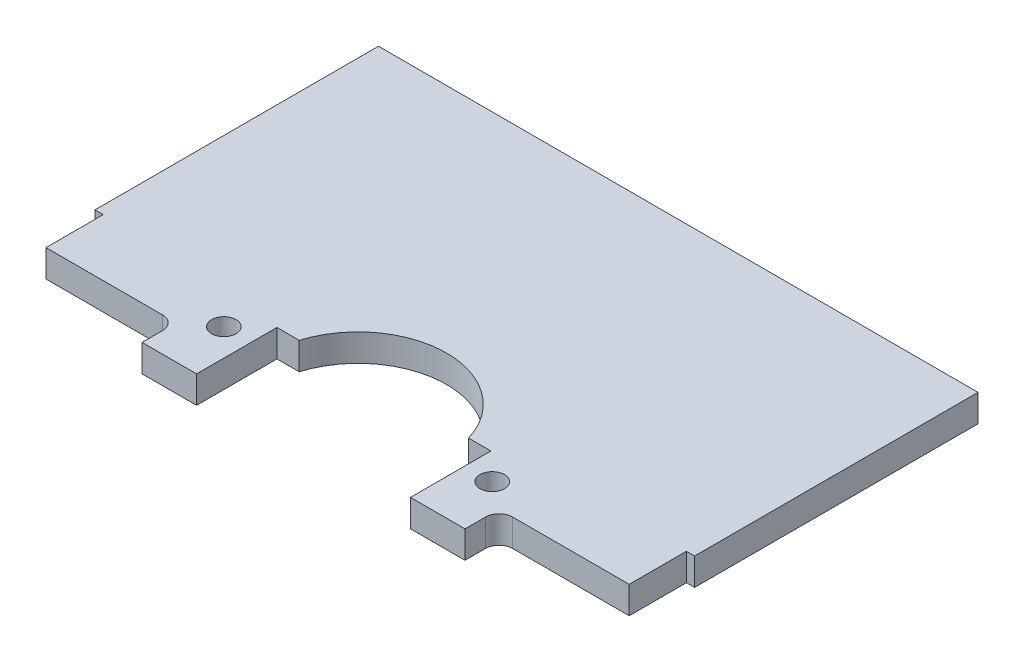
ISO-10303-21;
HEADER;
FILE_DESCRIPTION(('STEP AP214'),'2;1');
FILE_NAME('part.step','',(''),(''),'','','');
FILE_SCHEMA(('AUTOMOTIVE_DESIGN { 1 0 10303 214 1 1 1 1 }'));
ENDSEC;
DATA;
#1=APPLICATION_CONTEXT('core data for automotive mechanical design processes');
#2=APPLICATION_PROTOCOL_DEFINITION('international standard','automotive_design',2000,#1);
#3=PRODUCT_CONTEXT('',#1,'mechanical');
#4=PRODUCT('Part','Part','',(#3));
#5=PRODUCT_RELATED_PRODUCT_CATEGORY('part','',(#4));
#6=PRODUCT_DEFINITION_FORMATION('','',#4);
#7=PRODUCT_DEFINITION_CONTEXT('part definition',#1,'design');
#8=PRODUCT_DEFINITION('design','',#6,#7);
#9=PRODUCT_DEFINITION_SHAPE('','',#8);
#10=(LENGTH_UNIT() NAMED_UNIT(*) SI_UNIT(.MILLI.,.METRE.));
#11=(NAMED_UNIT(*) PLANE_ANGLE_UNIT() SI_UNIT($,.RADIAN.));
#12=(NAMED_UNIT(*) SI_UNIT($,.STERADIAN.) SOLID_ANGLE_UNIT());
#13=UNCERTAINTY_MEASURE_WITH_UNIT(LENGTH_MEASURE(1.E-05),#10,'distance_accuracy_value','');
#14=(GEOMETRIC_REPRESENTATION_CONTEXT(3) GLOBAL_UNCERTAINTY_ASSIGNED_CONTEXT((#13)) GLOBAL_UNIT_ASSIGNED_CONTEXT((#10,
#11,#12)) REPRESENTATION_CONTEXT('',''));
#15=CARTESIAN_POINT('',(0.,0.,0.));
#16=DIRECTION('',(0.,0.,1.));
#17=DIRECTION('',(1.,0.,0.));
#18=AXIS2_PLACEMENT_3D('',#15,#16,#17);
#19=CARTESIAN_POINT('',(0.,2.54,13.208));
#20=DIRECTION('',(0.,0.,-1.));
#21=DIRECTION('',(-1.,0.,0.));
#22=AXIS2_PLACEMENT_3D('',#19,#20,#21);
#23=PLANE('',#22);
#24=DIRECTION('',(1.,0.,0.));
#25=VECTOR('',#24,1.);
#26=CARTESIAN_POINT('',(0.,0.,13.208));
#27=LINE('',#26,#25);
#28=CARTESIAN_POINT('',(-27.94,0.,13.208));
#29=VERTEX_POINT('',#28);
#30=CARTESIAN_POINT('',(-27.178,0.,13.208));
#31=VERTEX_POINT('',#30);
#32=EDGE_CURVE('E189',#29,#31,#27,.T.);
#33=ORIENTED_EDGE('',*,*,#32,.T.);
#34=DIRECTION('',(0.,-1.,0.));
#35=VECTOR('',#34,1.);
#36=CARTESIAN_POINT('',(-27.178,2.54,13.208));
#37=LINE('',#36,#35);
#38=CARTESIAN_POINT('',(-27.178,2.54,13.208));
#39=VERTEX_POINT('',#38);
#40=EDGE_CURVE('E187',#39,#31,#37,.T.);
#41=ORIENTED_EDGE('',*,*,#40,.F.);
#42=DIRECTION('',(1.,0.,0.));
#43=VECTOR('',#42,1.);
#44=CARTESIAN_POINT('',(0.,2.54,13.208));
#45=LINE('',#44,#43);
#46=CARTESIAN_POINT('',(-27.94,2.54,13.208));
#47=VERTEX_POINT('',#46);
#48=EDGE_CURVE('E172',#47,#39,#45,.T.);
#49=ORIENTED_EDGE('',*,*,#48,.F.);
#50=DIRECTION('',(0.,-1.,0.));
#51=VECTOR('',#50,1.);
#52=CARTESIAN_POINT('',(-27.94,2.54,13.208));
#53=LINE('',#52,#51);
#54=EDGE_CURVE('E237',#47,#29,#53,.T.);
#55=ORIENTED_EDGE('',*,*,#54,.T.);
#56=EDGE_LOOP('',(#33,#41,#49,#55));
#57=FACE_BOUND('',#56,.T.);
#58=ADVANCED_FACE('F34',(#57),#23,.F.);
#59=CARTESIAN_POINT('',(-27.178,2.54,0.));
#60=DIRECTION('',(-1.,0.,0.));
#61=DIRECTION('',(0.,0.,1.));
#62=AXIS2_PLACEMENT_3D('',#59,#60,#61);
#63=PLANE('',#62);
#64=DIRECTION('',(0.,0.,-1.));
#65=VECTOR('',#64,1.);
#66=CARTESIAN_POINT('',(-27.178,0.,0.));
#67=LINE('',#66,#65);
#68=CARTESIAN_POINT('',(-27.178,0.,18.542));
#69=VERTEX_POINT('',#68);
#70=EDGE_CURVE('E239',#69,#31,#67,.T.);
#71=ORIENTED_EDGE('',*,*,#70,.F.);
#72=DIRECTION('',(0.,-1.,0.));
#73=VECTOR('',#72,1.);
#74=CARTESIAN_POINT('',(-27.178,2.54,18.542));
#75=LINE('',#74,#73);
#76=CARTESIAN_POINT('',(-27.178,2.54,18.542));
#77=VERTEX_POINT('',#76);
#78=EDGE_CURVE('E194',#77,#69,#75,.T.);
#79=ORIENTED_EDGE('',*,*,#78,.F.);
#80=DIRECTION('',(0.,0.,-1.));
#81=VECTOR('',#80,1.);
#82=CARTESIAN_POINT('',(-27.178,2.54,0.));
#83=LINE('',#82,#81);
#84=EDGE_CURVE('E178',#77,#39,#83,.T.);
#85=ORIENTED_EDGE('',*,*,#84,.T.);
#86=ORIENTED_EDGE('',*,*,#40,.T.);
#87=EDGE_LOOP('',(#71,#79,#85,#86));
#88=FACE_BOUND('',#87,.T.);
#89=ADVANCED_FACE('F196',(#88),#63,.T.);
#90=CARTESIAN_POINT('',(0.,2.54,18.542));
#91=DIRECTION('',(0.,0.,-1.));
#92=DIRECTION('',(-1.,0.,0.));
#93=AXIS2_PLACEMENT_3D('',#90,#91,#92);
#94=PLANE('',#93);
#95=DIRECTION('',(1.,0.,0.));
#96=VECTOR('',#95,1.);
#97=CARTESIAN_POINT('',(0.,0.,18.542));
#98=LINE('',#97,#96);
#99=CARTESIAN_POINT('',(-16.3195,0.,18.542));
#100=VERTEX_POINT('',#99);
#101=EDGE_CURVE('E242',#69,#100,#98,.T.);
#102=ORIENTED_EDGE('',*,*,#101,.T.);
#103=DIRECTION('',(0.,-1.,0.));
#104=VECTOR('',#103,1.);
#105=CARTESIAN_POINT('',(-16.3195,2.54,18.542));
#106=LINE('',#105,#104);
#107=CARTESIAN_POINT('',(-16.3195,2.54,18.542));
#108=VERTEX_POINT('',#107);
#109=EDGE_CURVE('E322',#100,#108,#106,.F.);
#110=ORIENTED_EDGE('',*,*,#109,.T.);
#111=DIRECTION('',(1.,0.,0.));
#112=VECTOR('',#111,1.);
#113=CARTESIAN_POINT('',(0.,2.54,18.542));
#114=LINE('',#113,#112);
#115=EDGE_CURVE('E198',#77,#108,#114,.T.);
#116=ORIENTED_EDGE('',*,*,#115,.F.);
#117=ORIENTED_EDGE('',*,*,#78,.T.);
#118=EDGE_LOOP('',(#102,#110,#116,#117));
#119=FACE_BOUND('',#118,.T.);
#120=ADVANCED_FACE('F346',(#119),#94,.F.);
#121=CARTESIAN_POINT('',(-15.0495,2.54,0.));
#122=DIRECTION('',(-1.,0.,0.));
#123=DIRECTION('',(0.,0.,1.));
#124=AXIS2_PLACEMENT_3D('',#121,#122,#123);
#125=PLANE('',#124);
#126=DIRECTION('',(0.,0.,-1.));
#127=VECTOR('',#126,1.);
#128=CARTESIAN_POINT('',(-15.0495,2.54,0.));
#129=LINE('',#128,#127);
#130=CARTESIAN_POINT('',(-15.0495,2.54,21.717));
#131=VERTEX_POINT('',#130);
#132=CARTESIAN_POINT('',(-15.0495,2.54,19.812));
#133=VERTEX_POINT('',#132);
#134=EDGE_CURVE('E200',#131,#133,#129,.T.);
#135=ORIENTED_EDGE('',*,*,#134,.T.);
#136=DIRECTION('',(0.,-1.,0.));
#137=VECTOR('',#136,1.);
#138=CARTESIAN_POINT('',(-15.0495,2.54,19.812));
#139=LINE('',#138,#137);
#140=CARTESIAN_POINT('',(-15.0495,0.,19.812));
#141=VERTEX_POINT('',#140);
#142=EDGE_CURVE('E193',#133,#141,#139,.T.);
#143=ORIENTED_EDGE('',*,*,#142,.T.);
#144=DIRECTION('',(0.,0.,-1.));
#145=VECTOR('',#144,1.);
#146=CARTESIAN_POINT('',(-15.0495,0.,0.));
#147=LINE('',#146,#145);
#148=CARTESIAN_POINT('',(-15.0495,0.,21.717));
#149=VERTEX_POINT('',#148);
#150=EDGE_CURVE('E245',#149,#141,#147,.T.);
#151=ORIENTED_EDGE('',*,*,#150,.F.);
#152=DIRECTION('',(0.,-1.,0.));
#153=VECTOR('',#152,1.);
#154=CARTESIAN_POINT('',(-15.0495,2.54,21.717));
#155=LINE('',#154,#153);
#156=EDGE_CURVE('E317',#131,#149,#155,.T.);
#157=ORIENTED_EDGE('',*,*,#156,.F.);
#158=EDGE_LOOP('',(#135,#143,#151,#157));
#159=FACE_BOUND('',#158,.T.);
#160=ADVANCED_FACE('F337',(#159),#125,.T.);
#161=CARTESIAN_POINT('',(0.,2.54,21.717));
#162=DIRECTION('',(0.,0.,-1.));
#163=DIRECTION('',(-1.,0.,0.));
#164=AXIS2_PLACEMENT_3D('',#161,#162,#163);
#165=PLANE('',#164);
#166=DIRECTION('',(1.,0.,0.));
#167=VECTOR('',#166,1.);
#168=CARTESIAN_POINT('',(0.,0.,21.717));
#169=LINE('',#168,#167);
#170=CARTESIAN_POINT('',(-9.9695,0.,21.717));
#171=VERTEX_POINT('',#170);
#172=EDGE_CURVE('E248',#149,#171,#169,.T.);
#173=ORIENTED_EDGE('',*,*,#172,.T.);
#174=DIRECTION('',(0.,-1.,0.));
#175=VECTOR('',#174,1.);
#176=CARTESIAN_POINT('',(-9.9695,2.54,21.717));
#177=LINE('',#176,#175);
#178=CARTESIAN_POINT('',(-9.9695,2.54,21.717));
#179=VERTEX_POINT('',#178);
#180=EDGE_CURVE('E314',#179,#171,#177,.T.);
#181=ORIENTED_EDGE('',*,*,#180,.F.);
#182=DIRECTION('',(1.,0.,0.));
#183=VECTOR('',#182,1.);
#184=CARTESIAN_POINT('',(0.,2.54,21.717));
#185=LINE('',#184,#183);
#186=EDGE_CURVE('E205',#131,#179,#185,.T.);
#187=ORIENTED_EDGE('',*,*,#186,.F.);
#188=ORIENTED_EDGE('',*,*,#156,.T.);
#189=EDGE_LOOP('',(#173,#181,#187,#188));
#190=FACE_BOUND('',#189,.T.);
#191=ADVANCED_FACE('F353',(#190),#165,.F.);
#192=CARTESIAN_POINT('',(-9.9695,2.54,0.));
#193=DIRECTION('',(-1.,0.,0.));
#194=DIRECTION('',(0.,0.,1.));
#195=AXIS2_PLACEMENT_3D('',#192,#193,#194);
#196=PLANE('',#195);
#197=DIRECTION('',(0.,0.,-1.));
#198=VECTOR('',#197,1.);
#199=CARTESIAN_POINT('',(-9.9695,0.,0.));
#200=LINE('',#199,#198);
#201=CARTESIAN_POINT('',(-9.9695,0.,14.224));
#202=VERTEX_POINT('',#201);
#203=EDGE_CURVE('E250',#171,#202,#200,.T.);
#204=ORIENTED_EDGE('',*,*,#203,.T.);
#205=DIRECTION('',(0.,-1.,0.));
#206=VECTOR('',#205,1.);
#207=CARTESIAN_POINT('',(-9.9695,2.54,14.224));
#208=LINE('',#207,#206);
#209=CARTESIAN_POINT('',(-9.9695,2.54,14.224));
#210=VERTEX_POINT('',#209);
#211=EDGE_CURVE('E311',#210,#202,#208,.T.);
#212=ORIENTED_EDGE('',*,*,#211,.F.);
#213=DIRECTION('',(0.,0.,-1.));
#214=VECTOR('',#213,1.);
#215=CARTESIAN_POINT('',(-9.9695,2.54,0.));
#216=LINE('',#215,#214);
#217=EDGE_CURVE('E207',#179,#210,#216,.T.);
#218=ORIENTED_EDGE('',*,*,#217,.F.);
#219=ORIENTED_EDGE('',*,*,#180,.T.);
#220=EDGE_LOOP('',(#204,#212,#218,#219));
#221=FACE_BOUND('',#220,.T.);
#222=ADVANCED_FACE('F528',(#221),#196,.F.);
#223=CARTESIAN_POINT('',(0.,2.54,14.224));
#224=DIRECTION('',(0.,0.,-1.));
#225=DIRECTION('',(-1.,0.,0.));
#226=AXIS2_PLACEMENT_3D('',#223,#224,#225);
#227=PLANE('',#226);
#228=DIRECTION('',(1.,0.,0.));
#229=VECTOR('',#228,1.);
#230=CARTESIAN_POINT('',(0.,0.,14.224));
#231=LINE('',#230,#229);
#232=CARTESIAN_POINT('',(-7.89445729610339,0.,14.224));
#233=VERTEX_POINT('',#232);
#234=EDGE_CURVE('E252',#202,#233,#231,.T.);
#235=ORIENTED_EDGE('',*,*,#234,.T.);
#236=DIRECTION('',(0.,-1.,0.));
#237=VECTOR('',#236,1.);
#238=CARTESIAN_POINT('',(-7.89445729610339,2.54,14.224));
#239=LINE('',#238,#237);
#240=CARTESIAN_POINT('',(-7.89445729610339,2.54,14.224));
#241=VERTEX_POINT('',#240);
#242=EDGE_CURVE('E308',#241,#233,#239,.T.);
#243=ORIENTED_EDGE('',*,*,#242,.F.);
#244=DIRECTION('',(1.,0.,0.));
#245=VECTOR('',#244,1.);
#246=CARTESIAN_POINT('',(0.,2.54,14.224));
#247=LINE('',#246,#245);
#248=EDGE_CURVE('E209',#210,#241,#247,.T.);
#249=ORIENTED_EDGE('',*,*,#248,.F.);
#250=ORIENTED_EDGE('',*,*,#211,.T.);
#251=EDGE_LOOP('',(#235,#243,#249,#250));
#252=FACE_BOUND('',#251,.T.);
#253=ADVANCED_FACE('F524',(#252),#227,.F.);
#254=CARTESIAN_POINT('',(0.,2.54,16.637));
#255=DIRECTION('',(0.,-1.,0.));
#256=DIRECTION('',(0.,0.,-1.));
#257=AXIS2_PLACEMENT_3D('',#254,#255,#256);
#258=CYLINDRICAL_SURFACE('',#257,8.255);
#259=CARTESIAN_POINT('',(0.,0.,16.637));
#260=DIRECTION('',(0.,1.,0.));
#261=DIRECTION('',(0.,0.,1.));
#262=AXIS2_PLACEMENT_3D('',#259,#260,#261);
#263=CIRCLE('',#262,8.255);
#264=CARTESIAN_POINT('',(7.89445729610339,0.,14.224));
#265=VERTEX_POINT('',#264);
#266=EDGE_CURVE('E254',#233,#265,#263,.F.);
#267=ORIENTED_EDGE('',*,*,#266,.T.);
#268=DIRECTION('',(0.,-1.,0.));
#269=VECTOR('',#268,1.);
#270=CARTESIAN_POINT('',(7.89445729610339,2.54,14.224));
#271=LINE('',#270,#269);
#272=CARTESIAN_POINT('',(7.89445729610339,2.54,14.224));
#273=VERTEX_POINT('',#272);
#274=EDGE_CURVE('E305',#273,#265,#271,.T.);
#275=ORIENTED_EDGE('',*,*,#274,.F.);
#276=CARTESIAN_POINT('',(0.,2.54,16.637));
#277=DIRECTION('',(0.,1.,0.));
#278=DIRECTION('',(0.,0.,1.));
#279=AXIS2_PLACEMENT_3D('',#276,#277,#278);
#280=CIRCLE('',#279,8.255);
#281=EDGE_CURVE('E211',#241,#273,#280,.F.);
#282=ORIENTED_EDGE('',*,*,#281,.F.);
#283=ORIENTED_EDGE('',*,*,#242,.T.);
#284=EDGE_LOOP('',(#267,#275,#282,#283));
#285=FACE_BOUND('',#284,.T.);
#286=ADVANCED_FACE('F519',(#285),#258,.F.);
#287=CARTESIAN_POINT('',(0.,2.54,14.224));
#288=DIRECTION('',(0.,0.,-1.));
#289=DIRECTION('',(-1.,0.,0.));
#290=AXIS2_PLACEMENT_3D('',#287,#288,#289);
#291=PLANE('',#290);
#292=DIRECTION('',(1.,0.,0.));
#293=VECTOR('',#292,1.);
#294=CARTESIAN_POINT('',(0.,0.,14.224));
#295=LINE('',#294,#293);
#296=CARTESIAN_POINT('',(9.9695,0.,14.224));
#297=VERTEX_POINT('',#296);
#298=EDGE_CURVE('E256',#265,#297,#295,.T.);
#299=ORIENTED_EDGE('',*,*,#298,.T.);
#300=DIRECTION('',(0.,-1.,0.));
#301=VECTOR('',#300,1.);
#302=CARTESIAN_POINT('',(9.9695,2.54,14.224));
#303=LINE('',#302,#301);
#304=CARTESIAN_POINT('',(9.9695,2.54,14.224));
#305=VERTEX_POINT('',#304);
#306=EDGE_CURVE('E302',#305,#297,#303,.T.);
#307=ORIENTED_EDGE('',*,*,#306,.F.);
#308=DIRECTION('',(1.,0.,0.));
#309=VECTOR('',#308,1.);
#310=CARTESIAN_POINT('',(0.,2.54,14.224));
#311=LINE('',#310,#309);
#312=EDGE_CURVE('E213',#273,#305,#311,.T.);
#313=ORIENTED_EDGE('',*,*,#312,.F.);
#314=ORIENTED_EDGE('',*,*,#274,.T.);
#315=EDGE_LOOP('',(#299,#307,#313,#314));
#316=FACE_BOUND('',#315,.T.);
#317=ADVANCED_FACE('F513',(#316),#291,.F.);
#318=CARTESIAN_POINT('',(9.9695,2.54,0.));
#319=DIRECTION('',(1.,0.,0.));
#320=DIRECTION('',(0.,0.,-1.));
#321=AXIS2_PLACEMENT_3D('',#318,#319,#320);
#322=PLANE('',#321);
#323=DIRECTION('',(0.,0.,1.));
#324=VECTOR('',#323,1.);
#325=CARTESIAN_POINT('',(9.9695,0.,0.));
#326=LINE('',#325,#324);
#327=CARTESIAN_POINT('',(9.9695,0.,21.717));
#328=VERTEX_POINT('',#327);
#329=EDGE_CURVE('E258',#297,#328,#326,.T.);
#330=ORIENTED_EDGE('',*,*,#329,.T.);
#331=DIRECTION('',(0.,-1.,0.));
#332=VECTOR('',#331,1.);
#333=CARTESIAN_POINT('',(9.9695,2.54,21.717));
#334=LINE('',#333,#332);
#335=CARTESIAN_POINT('',(9.9695,2.54,21.717));
#336=VERTEX_POINT('',#335);
#337=EDGE_CURVE('E299',#336,#328,#334,.T.);
#338=ORIENTED_EDGE('',*,*,#337,.F.);
#339=DIRECTION('',(0.,0.,1.));
#340=VECTOR('',#339,1.);
#341=CARTESIAN_POINT('',(9.9695,2.54,0.));
#342=LINE('',#341,#340);
#343=EDGE_CURVE('E215',#305,#336,#342,.T.);
#344=ORIENTED_EDGE('',*,*,#343,.F.);
#345=ORIENTED_EDGE('',*,*,#306,.T.);
#346=EDGE_LOOP('',(#330,#338,#344,#345));
#347=FACE_BOUND('',#346,.T.);
#348=ADVANCED_FACE('F509',(#347),#322,.F.);
#349=CARTESIAN_POINT('',(0.,2.54,21.717));
#350=DIRECTION('',(0.,0.,-1.));
#351=DIRECTION('',(-1.,0.,0.));
#352=AXIS2_PLACEMENT_3D('',#349,#350,#351);
#353=PLANE('',#352);
#354=DIRECTION('',(1.,0.,0.));
#355=VECTOR('',#354,1.);
#356=CARTESIAN_POINT('',(0.,0.,21.717));
#357=LINE('',#356,#355);
#358=CARTESIAN_POINT('',(15.0495,0.,21.717));
#359=VERTEX_POINT('',#358);
#360=EDGE_CURVE('E260',#328,#359,#357,.T.);
#361=ORIENTED_EDGE('',*,*,#360,.T.);
#362=DIRECTION('',(0.,-1.,0.));
#363=VECTOR('',#362,1.);
#364=CARTESIAN_POINT('',(15.0495,2.54,21.717));
#365=LINE('',#364,#363);
#366=CARTESIAN_POINT('',(15.0495,2.54,21.717));
#367=VERTEX_POINT('',#366);
#368=EDGE_CURVE('E296',#367,#359,#365,.T.);
#369=ORIENTED_EDGE('',*,*,#368,.F.);
#370=DIRECTION('',(1.,0.,0.));
#371=VECTOR('',#370,1.);
#372=CARTESIAN_POINT('',(0.,2.54,21.717));
#373=LINE('',#372,#371);
#374=EDGE_CURVE('E217',#336,#367,#373,.T.);
#375=ORIENTED_EDGE('',*,*,#374,.F.);
#376=ORIENTED_EDGE('',*,*,#337,.T.);
#377=EDGE_LOOP('',(#361,#369,#375,#376));
#378=FACE_BOUND('',#377,.T.);
#379=ADVANCED_FACE('F445',(#378),#353,.F.);
#380=CARTESIAN_POINT('',(15.0495,2.54,0.));
#381=DIRECTION('',(-1.,0.,0.));
#382=DIRECTION('',(0.,0.,1.));
#383=AXIS2_PLACEMENT_3D('',#380,#381,#382);
#384=PLANE('',#383);
#385=DIRECTION('',(0.,0.,-1.));
#386=VECTOR('',#385,1.);
#387=CARTESIAN_POINT('',(15.0495,0.,0.));
#388=LINE('',#387,#386);
#389=CARTESIAN_POINT('',(15.0495,0.,19.812));
#390=VERTEX_POINT('',#389);
#391=EDGE_CURVE('E262',#359,#390,#388,.T.);
#392=ORIENTED_EDGE('',*,*,#391,.T.);
#393=DIRECTION('',(0.,-1.,0.));
#394=VECTOR('',#393,1.);
#395=CARTESIAN_POINT('',(15.0495,2.54,19.812));
#396=LINE('',#395,#394);
#397=CARTESIAN_POINT('',(15.0495,2.54,19.812));
#398=VERTEX_POINT('',#397);
#399=EDGE_CURVE('E49',#390,#398,#396,.F.);
#400=ORIENTED_EDGE('',*,*,#399,.T.);
#401=DIRECTION('',(0.,0.,-1.));
#402=VECTOR('',#401,1.);
#403=CARTESIAN_POINT('',(15.0495,2.54,0.));
#404=LINE('',#403,#402);
#405=EDGE_CURVE('E219',#367,#398,#404,.T.);
#406=ORIENTED_EDGE('',*,*,#405,.F.);
#407=ORIENTED_EDGE('',*,*,#368,.T.);
#408=EDGE_LOOP('',(#392,#400,#406,#407));
#409=FACE_BOUND('',#408,.T.);
#410=ADVANCED_FACE('F440',(#409),#384,.F.);
#411=CARTESIAN_POINT('',(0.,2.54,18.542));
#412=DIRECTION('',(0.,0.,-1.));
#413=DIRECTION('',(-1.,0.,0.));
#414=AXIS2_PLACEMENT_3D('',#411,#412,#413);
#415=PLANE('',#414);
#416=DIRECTION('',(1.,0.,0.));
#417=VECTOR('',#416,1.);
#418=CARTESIAN_POINT('',(0.,2.54,18.542));
#419=LINE('',#418,#417);
#420=CARTESIAN_POINT('',(16.3195,2.54,18.542));
#421=VERTEX_POINT('',#420);
#422=CARTESIAN_POINT('',(27.178,2.54,18.542));
#423=VERTEX_POINT('',#422);
#424=EDGE_CURVE('E221',#421,#423,#419,.T.);
#425=ORIENTED_EDGE('',*,*,#424,.F.);
#426=DIRECTION('',(0.,-1.,0.));
#427=VECTOR('',#426,1.);
#428=CARTESIAN_POINT('',(16.3195,0.,18.542));
#429=LINE('',#428,#427);
#430=CARTESIAN_POINT('',(16.3195,0.,18.542));
#431=VERTEX_POINT('',#430);
#432=EDGE_CURVE('E324',#421,#431,#429,.T.);
#433=ORIENTED_EDGE('',*,*,#432,.T.);
#434=DIRECTION('',(1.,0.,0.));
#435=VECTOR('',#434,1.);
#436=CARTESIAN_POINT('',(0.,0.,18.542));
#437=LINE('',#436,#435);
#438=CARTESIAN_POINT('',(27.178,0.,18.542));
#439=VERTEX_POINT('',#438);
#440=EDGE_CURVE('E264',#431,#439,#437,.T.);
#441=ORIENTED_EDGE('',*,*,#440,.T.);
#442=DIRECTION('',(0.,-1.,0.));
#443=VECTOR('',#442,1.);
#444=CARTESIAN_POINT('',(27.178,2.54,18.542));
#445=LINE('',#444,#443);
#446=EDGE_CURVE('E293',#423,#439,#445,.T.);
#447=ORIENTED_EDGE('',*,*,#446,.F.);
#448=EDGE_LOOP('',(#425,#433,#441,#447));
#449=FACE_BOUND('',#448,.T.);
#450=ADVANCED_FACE('F373',(#449),#415,.F.);
#451=CARTESIAN_POINT('',(27.178,2.54,0.));
#452=DIRECTION('',(-1.,0.,0.));
#453=DIRECTION('',(0.,0.,1.));
#454=AXIS2_PLACEMENT_3D('',#451,#452,#453);
#455=PLANE('',#454);
#456=DIRECTION('',(0.,0.,-1.));
#457=VECTOR('',#456,1.);
#458=CARTESIAN_POINT('',(27.178,0.,0.));
#459=LINE('',#458,#457);
#460=CARTESIAN_POINT('',(27.178,0.,13.208));
#461=VERTEX_POINT('',#460);
#462=EDGE_CURVE('E266',#439,#461,#459,.T.);
#463=ORIENTED_EDGE('',*,*,#462,.T.);
#464=DIRECTION('',(0.,-1.,0.));
#465=VECTOR('',#464,1.);
#466=CARTESIAN_POINT('',(27.178,2.54,13.208));
#467=LINE('',#466,#465);
#468=CARTESIAN_POINT('',(27.178,2.54,13.208));
#469=VERTEX_POINT('',#468);
#470=EDGE_CURVE('E290',#469,#461,#467,.T.);
#471=ORIENTED_EDGE('',*,*,#470,.F.);
#472=DIRECTION('',(0.,0.,-1.));
#473=VECTOR('',#472,1.);
#474=CARTESIAN_POINT('',(27.178,2.54,0.));
#475=LINE('',#474,#473);
#476=EDGE_CURVE('E223',#423,#469,#475,.T.);
#477=ORIENTED_EDGE('',*,*,#476,.F.);
#478=ORIENTED_EDGE('',*,*,#446,.T.);
#479=EDGE_LOOP('',(#463,#471,#477,#478));
#480=FACE_BOUND('',#479,.T.);
#481=ADVANCED_FACE('F365',(#480),#455,.F.);
#482=CARTESIAN_POINT('',(27.94,0.,13.208));
#483=VERTEX_POINT('',#482);
#484=EDGE_CURVE('E240',#461,#483,#27,.T.);
#485=ORIENTED_EDGE('',*,*,#484,.T.);
#486=DIRECTION('',(0.,-1.,0.));
#487=VECTOR('',#486,1.);
#488=CARTESIAN_POINT('',(27.94,2.54,13.208));
#489=LINE('',#488,#487);
#490=CARTESIAN_POINT('',(27.94,2.54,13.208));
#491=VERTEX_POINT('',#490);
#492=EDGE_CURVE('E287',#491,#483,#489,.T.);
#493=ORIENTED_EDGE('',*,*,#492,.F.);
#494=EDGE_CURVE('E185',#469,#491,#45,.T.);
#495=ORIENTED_EDGE('',*,*,#494,.F.);
#496=ORIENTED_EDGE('',*,*,#470,.T.);
#497=EDGE_LOOP('',(#485,#493,#495,#496));
#498=FACE_BOUND('',#497,.T.);
#499=ADVANCED_FACE('F358',(#498),#23,.F.);
#500=CARTESIAN_POINT('',(27.94,2.54,0.));
#501=DIRECTION('',(-1.,0.,0.));
#502=DIRECTION('',(0.,0.,1.));
#503=AXIS2_PLACEMENT_3D('',#500,#501,#502);
#504=PLANE('',#503);
#505=DIRECTION('',(0.,0.,-1.));
#506=VECTOR('',#505,1.);
#507=CARTESIAN_POINT('',(27.94,0.,0.));
#508=LINE('',#507,#506);
#509=CARTESIAN_POINT('',(27.94,0.,-13.208));
#510=VERTEX_POINT('',#509);
#511=EDGE_CURVE('E268',#483,#510,#508,.T.);
#512=ORIENTED_EDGE('',*,*,#511,.T.);
#513=DIRECTION('',(0.,-1.,0.));
#514=VECTOR('',#513,1.);
#515=CARTESIAN_POINT('',(27.94,2.54,-13.208));
#516=LINE('',#515,#514);
#517=CARTESIAN_POINT('',(27.94,2.54,-13.208));
#518=VERTEX_POINT('',#517);
#519=EDGE_CURVE('E285',#518,#510,#516,.T.);
#520=ORIENTED_EDGE('',*,*,#519,.F.);
#521=DIRECTION('',(0.,0.,-1.));
#522=VECTOR('',#521,1.);
#523=CARTESIAN_POINT('',(27.94,2.54,0.));
#524=LINE('',#523,#522);
#525=EDGE_CURVE('E225',#491,#518,#524,.T.);
#526=ORIENTED_EDGE('',*,*,#525,.F.);
#527=ORIENTED_EDGE('',*,*,#492,.T.);
#528=EDGE_LOOP('',(#512,#520,#526,#527));
#529=FACE_BOUND('',#528,.T.);
#530=ADVANCED_FACE('F364',(#529),#504,.F.);
#531=CARTESIAN_POINT('',(0.,2.54,-13.208));
#532=DIRECTION('',(0.,0.,-1.));
#533=DIRECTION('',(-1.,0.,0.));
#534=AXIS2_PLACEMENT_3D('',#531,#532,#533);
#535=PLANE('',#534);
#536=DIRECTION('',(1.,0.,0.));
#537=VECTOR('',#536,1.);
#538=CARTESIAN_POINT('',(0.,0.,-13.208));
#539=LINE('',#538,#537);
#540=CARTESIAN_POINT('',(-27.94,0.,-13.208));
#541=VERTEX_POINT('',#540);
#542=EDGE_CURVE('E271',#541,#510,#539,.T.);
#543=ORIENTED_EDGE('',*,*,#542,.F.);
#544=DIRECTION('',(0.,-1.,0.));
#545=VECTOR('',#544,1.);
#546=CARTESIAN_POINT('',(-27.94,2.54,-13.208));
#547=LINE('',#546,#545);
#548=CARTESIAN_POINT('',(-27.94,2.54,-13.208));
#549=VERTEX_POINT('',#548);
#550=EDGE_CURVE('E283',#549,#541,#547,.T.);
#551=ORIENTED_EDGE('',*,*,#550,.F.);
#552=DIRECTION('',(1.,0.,0.));
#553=VECTOR('',#552,1.);
#554=CARTESIAN_POINT('',(0.,2.54,-13.208));
#555=LINE('',#554,#553);
#556=EDGE_CURVE('E227',#549,#518,#555,.T.);
#557=ORIENTED_EDGE('',*,*,#556,.T.);
#558=ORIENTED_EDGE('',*,*,#519,.T.);
#559=EDGE_LOOP('',(#543,#551,#557,#558));
#560=FACE_BOUND('',#559,.T.);
#561=ADVANCED_FACE('F371',(#560),#535,.T.);
#562=CARTESIAN_POINT('',(12.5095,2.54,16.637));
#563=DIRECTION('',(0.,-1.,0.));
#564=DIRECTION('',(0.,0.,-1.));
#565=AXIS2_PLACEMENT_3D('',#562,#563,#564);
#566=CYLINDRICAL_SURFACE('',#565,1.143);
#567=CARTESIAN_POINT('',(12.5095,2.54,16.637));
#568=DIRECTION('',(0.,1.,0.));
#569=DIRECTION('',(0.,0.,1.));
#570=AXIS2_PLACEMENT_3D('',#567,#568,#569);
#571=CIRCLE('',#570,1.143);
#572=CARTESIAN_POINT('',(12.5095,2.54,17.78));
#573=VERTEX_POINT('',#572);
#574=EDGE_CURVE('E231',#573,#573,#571,.T.);
#575=ORIENTED_EDGE('',*,*,#574,.T.);
#576=EDGE_LOOP('',(#575));
#577=FACE_BOUND('',#576,.T.);
#578=CARTESIAN_POINT('',(12.5095,0.,16.637));
#579=DIRECTION('',(0.,1.,0.));
#580=DIRECTION('',(0.,0.,1.));
#581=AXIS2_PLACEMENT_3D('',#578,#579,#580);
#582=CIRCLE('',#581,1.143);
#583=CARTESIAN_POINT('',(12.5095,0.,17.78));
#584=VERTEX_POINT('',#583);
#585=EDGE_CURVE('E277',#584,#584,#582,.T.);
#586=ORIENTED_EDGE('',*,*,#585,.F.);
#587=EDGE_LOOP('',(#586));
#588=FACE_BOUND('',#587,.T.);
#589=ADVANCED_FACE('F390',(#577,#588),#566,.F.);
#590=CARTESIAN_POINT('',(-27.94,2.54,0.));
#591=DIRECTION('',(-1.,0.,0.));
#592=DIRECTION('',(0.,0.,1.));
#593=AXIS2_PLACEMENT_3D('',#590,#591,#592);
#594=PLANE('',#593);
#595=DIRECTION('',(0.,0.,-1.));
#596=VECTOR('',#595,1.);
#597=CARTESIAN_POINT('',(-27.94,0.,0.));
#598=LINE('',#597,#596);
#599=EDGE_CURVE('E274',#29,#541,#598,.T.);
#600=ORIENTED_EDGE('',*,*,#599,.F.);
#601=ORIENTED_EDGE('',*,*,#54,.F.);
#602=DIRECTION('',(0.,0.,-1.));
#603=VECTOR('',#602,1.);
#604=CARTESIAN_POINT('',(-27.94,2.54,0.));
#605=LINE('',#604,#603);
#606=EDGE_CURVE('E181',#47,#549,#605,.T.);
#607=ORIENTED_EDGE('',*,*,#606,.T.);
#608=ORIENTED_EDGE('',*,*,#550,.T.);
#609=EDGE_LOOP('',(#600,#601,#607,#608));
#610=FACE_BOUND('',#609,.T.);
#611=ADVANCED_FACE('F387',(#610),#594,.T.);
#612=CARTESIAN_POINT('',(-12.5095,2.54,16.637));
#613=DIRECTION('',(0.,-1.,0.));
#614=DIRECTION('',(0.,0.,-1.));
#615=AXIS2_PLACEMENT_3D('',#612,#613,#614);
#616=CYLINDRICAL_SURFACE('',#615,1.143);
#617=CARTESIAN_POINT('',(-12.5095,2.54,16.637));
#618=DIRECTION('',(0.,1.,0.));
#619=DIRECTION('',(0.,0.,1.));
#620=AXIS2_PLACEMENT_3D('',#617,#618,#619);
#621=CIRCLE('',#620,1.143);
#622=CARTESIAN_POINT('',(-12.5095,2.54,17.78));
#623=VERTEX_POINT('',#622);
#624=EDGE_CURVE('E234',#623,#623,#621,.T.);
#625=ORIENTED_EDGE('',*,*,#624,.T.);
#626=EDGE_LOOP('',(#625));
#627=FACE_BOUND('',#626,.T.);
#628=CARTESIAN_POINT('',(-12.5095,0.,16.637));
#629=DIRECTION('',(0.,1.,0.));
#630=DIRECTION('',(0.,0.,1.));
#631=AXIS2_PLACEMENT_3D('',#628,#629,#630);
#632=CIRCLE('',#631,1.143);
#633=CARTESIAN_POINT('',(-12.5095,0.,17.78));
#634=VERTEX_POINT('',#633);
#635=EDGE_CURVE('E183',#634,#634,#632,.T.);
#636=ORIENTED_EDGE('',*,*,#635,.F.);
#637=EDGE_LOOP('',(#636));
#638=FACE_BOUND('',#637,.T.);
#639=ADVANCED_FACE('F389',(#627,#638),#616,.F.);
#640=CARTESIAN_POINT('',(0.,2.54,0.));
#641=DIRECTION('',(0.,1.,0.));
#642=DIRECTION('',(0.,0.,1.));
#643=AXIS2_PLACEMENT_3D('',#640,#641,#642);
#644=PLANE('',#643);
#645=ORIENTED_EDGE('',*,*,#48,.T.);
#646=ORIENTED_EDGE('',*,*,#84,.F.);
#647=ORIENTED_EDGE('',*,*,#115,.T.);
#648=CARTESIAN_POINT('',(-16.3195,2.54,19.812));
#649=DIRECTION('',(0.,1.,0.));
#650=DIRECTION('',(0.,0.,1.));
#651=AXIS2_PLACEMENT_3D('',#648,#649,#650);
#652=CIRCLE('',#651,1.27);
#653=EDGE_CURVE('E330',#108,#133,#652,.F.);
#654=ORIENTED_EDGE('',*,*,#653,.T.);
#655=ORIENTED_EDGE('',*,*,#134,.F.);
#656=ORIENTED_EDGE('',*,*,#186,.T.);
#657=ORIENTED_EDGE('',*,*,#217,.T.);
#658=ORIENTED_EDGE('',*,*,#248,.T.);
#659=ORIENTED_EDGE('',*,*,#281,.T.);
#660=ORIENTED_EDGE('',*,*,#312,.T.);
#661=ORIENTED_EDGE('',*,*,#343,.T.);
#662=ORIENTED_EDGE('',*,*,#374,.T.);
#663=ORIENTED_EDGE('',*,*,#405,.T.);
#664=CARTESIAN_POINT('',(16.3195,2.54,19.812));
#665=DIRECTION('',(0.,1.,0.));
#666=DIRECTION('',(0.,0.,1.));
#667=AXIS2_PLACEMENT_3D('',#664,#665,#666);
#668=CIRCLE('',#667,1.27);
#669=EDGE_CURVE('E11',#398,#421,#668,.F.);
#670=ORIENTED_EDGE('',*,*,#669,.T.);
#671=ORIENTED_EDGE('',*,*,#424,.T.);
#672=ORIENTED_EDGE('',*,*,#476,.T.);
#673=ORIENTED_EDGE('',*,*,#494,.T.);
#674=ORIENTED_EDGE('',*,*,#525,.T.);
#675=ORIENTED_EDGE('',*,*,#556,.F.);
#676=ORIENTED_EDGE('',*,*,#606,.F.);
#677=EDGE_LOOP('',(#645,#646,#647,#654,#655,#656,#657,#658,#659,#660,#661,#662,#663,#670,#671,
#672,#673,#674,#675,#676));
#678=FACE_BOUND('',#677,.T.);
#679=ORIENTED_EDGE('',*,*,#574,.F.);
#680=EDGE_LOOP('',(#679));
#681=FACE_BOUND('',#680,.T.);
#682=ORIENTED_EDGE('',*,*,#624,.F.);
#683=EDGE_LOOP('',(#682));
#684=FACE_BOUND('',#683,.T.);
#685=ADVANCED_FACE('F174',(#678,#681,#684),#644,.T.);
#686=CARTESIAN_POINT('',(0.,0.,0.));
#687=DIRECTION('',(0.,1.,0.));
#688=DIRECTION('',(0.,0.,1.));
#689=AXIS2_PLACEMENT_3D('',#686,#687,#688);
#690=PLANE('',#689);
#691=ORIENTED_EDGE('',*,*,#32,.F.);
#692=ORIENTED_EDGE('',*,*,#599,.T.);
#693=ORIENTED_EDGE('',*,*,#542,.T.);
#694=ORIENTED_EDGE('',*,*,#511,.F.);
#695=ORIENTED_EDGE('',*,*,#484,.F.);
#696=ORIENTED_EDGE('',*,*,#462,.F.);
#697=ORIENTED_EDGE('',*,*,#440,.F.);
#698=CARTESIAN_POINT('',(16.3195,0.,19.812));
#699=DIRECTION('',(0.,1.,0.));
#700=DIRECTION('',(0.,0.,1.));
#701=AXIS2_PLACEMENT_3D('',#698,#699,#700);
#702=CIRCLE('',#701,1.27);
#703=EDGE_CURVE('E42',#431,#390,#702,.T.);
#704=ORIENTED_EDGE('',*,*,#703,.T.);
#705=ORIENTED_EDGE('',*,*,#391,.F.);
#706=ORIENTED_EDGE('',*,*,#360,.F.);
#707=ORIENTED_EDGE('',*,*,#329,.F.);
#708=ORIENTED_EDGE('',*,*,#298,.F.);
#709=ORIENTED_EDGE('',*,*,#266,.F.);
#710=ORIENTED_EDGE('',*,*,#234,.F.);
#711=ORIENTED_EDGE('',*,*,#203,.F.);
#712=ORIENTED_EDGE('',*,*,#172,.F.);
#713=ORIENTED_EDGE('',*,*,#150,.T.);
#714=CARTESIAN_POINT('',(-16.3195,0.,19.812));
#715=DIRECTION('',(0.,1.,0.));
#716=DIRECTION('',(0.,0.,1.));
#717=AXIS2_PLACEMENT_3D('',#714,#715,#716);
#718=CIRCLE('',#717,1.27);
#719=EDGE_CURVE('E328',#141,#100,#718,.T.);
#720=ORIENTED_EDGE('',*,*,#719,.T.);
#721=ORIENTED_EDGE('',*,*,#101,.F.);
#722=ORIENTED_EDGE('',*,*,#70,.T.);
#723=EDGE_LOOP('',(#691,#692,#693,#694,#695,#696,#697,#704,#705,#706,#707,#708,#709,#710,#711,
#712,#713,#720,#721,#722));
#724=FACE_BOUND('',#723,.T.);
#725=ORIENTED_EDGE('',*,*,#585,.T.);
#726=EDGE_LOOP('',(#725));
#727=FACE_BOUND('',#726,.T.);
#728=ORIENTED_EDGE('',*,*,#635,.T.);
#729=EDGE_LOOP('',(#728));
#730=FACE_BOUND('',#729,.T.);
#731=ADVANCED_FACE('F342',(#724,#727,#730),#690,.F.);
#732=CARTESIAN_POINT('',(-16.3195,2.54,19.812));
#733=DIRECTION('',(0.,-1.,0.));
#734=DIRECTION('',(0.,0.,-1.));
#735=AXIS2_PLACEMENT_3D('',#732,#733,#734);
#736=CYLINDRICAL_SURFACE('',#735,1.27);
#737=ORIENTED_EDGE('',*,*,#653,.F.);
#738=ORIENTED_EDGE('',*,*,#109,.F.);
#739=ORIENTED_EDGE('',*,*,#719,.F.);
#740=ORIENTED_EDGE('',*,*,#142,.F.);
#741=EDGE_LOOP('',(#737,#738,#739,#740));
#742=FACE_BOUND('',#741,.T.);
#743=ADVANCED_FACE('F340',(#742),#736,.F.);
#744=CARTESIAN_POINT('',(16.3195,2.54,19.812));
#745=DIRECTION('',(0.,1.,0.));
#746=DIRECTION('',(0.,0.,1.));
#747=AXIS2_PLACEMENT_3D('',#744,#745,#746);
#748=CYLINDRICAL_SURFACE('',#747,1.27);
#749=ORIENTED_EDGE('',*,*,#669,.F.);
#750=ORIENTED_EDGE('',*,*,#399,.F.);
#751=ORIENTED_EDGE('',*,*,#703,.F.);
#752=ORIENTED_EDGE('',*,*,#432,.F.);
#753=EDGE_LOOP('',(#749,#750,#751,#752));
#754=FACE_BOUND('',#753,.T.);
#755=ADVANCED_FACE('F36',(#754),#748,.F.);
#756=CLOSED_SHELL('',(#58,#89,#120,#160,#191,#222,#253,#286,#317,#348,#379,#410,#450,#481,#499,
#530,#561,#589,#611,#639,#685,#731,#743,#755));
#757=MANIFOLD_SOLID_BREP('B2',#756);
#758=ADVANCED_BREP_SHAPE_REPRESENTATION('',(#18,#757),#14);
#759=SHAPE_DEFINITION_REPRESENTATION(#9,#758);
ENDSEC;
END-ISO-10303-21;
